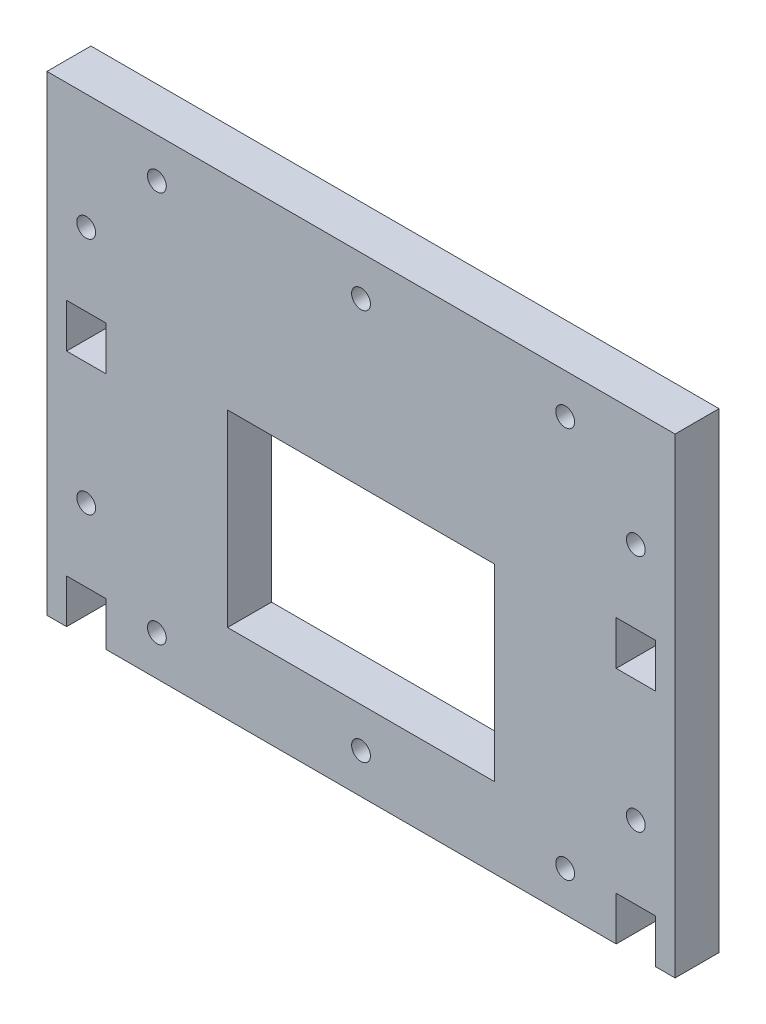
ISO-10303-21;
HEADER;
FILE_DESCRIPTION(('STEP AP214'),'2;1');
FILE_NAME('part.step','',(''),(''),'','','');
FILE_SCHEMA(('AUTOMOTIVE_DESIGN { 1 0 10303 214 1 1 1 1 }'));
ENDSEC;
DATA;
#1=APPLICATION_CONTEXT('core data for automotive mechanical design processes');
#2=APPLICATION_PROTOCOL_DEFINITION('international standard','automotive_design',2000,#1);
#3=PRODUCT_CONTEXT('',#1,'mechanical');
#4=PRODUCT('Part','Part','',(#3));
#5=PRODUCT_RELATED_PRODUCT_CATEGORY('part','',(#4));
#6=PRODUCT_DEFINITION_FORMATION('','',#4);
#7=PRODUCT_DEFINITION_CONTEXT('part definition',#1,'design');
#8=PRODUCT_DEFINITION('design','',#6,#7);
#9=PRODUCT_DEFINITION_SHAPE('','',#8);
#10=(LENGTH_UNIT() NAMED_UNIT(*) SI_UNIT(.MILLI.,.METRE.));
#11=(NAMED_UNIT(*) PLANE_ANGLE_UNIT() SI_UNIT($,.RADIAN.));
#12=(NAMED_UNIT(*) SI_UNIT($,.STERADIAN.) SOLID_ANGLE_UNIT());
#13=UNCERTAINTY_MEASURE_WITH_UNIT(LENGTH_MEASURE(1.E-05),#10,'distance_accuracy_value','');
#14=(GEOMETRIC_REPRESENTATION_CONTEXT(3) GLOBAL_UNCERTAINTY_ASSIGNED_CONTEXT((#13)) GLOBAL_UNIT_ASSIGNED_CONTEXT((#10,
#11,#12)) REPRESENTATION_CONTEXT('',''));
#15=CARTESIAN_POINT('',(0.,0.,0.));
#16=DIRECTION('',(0.,0.,1.));
#17=DIRECTION('',(1.,0.,0.));
#18=AXIS2_PLACEMENT_3D('',#15,#16,#17);
#19=CARTESIAN_POINT('',(0.,0.,14.));
#20=DIRECTION('',(0.,1.,0.));
#21=DIRECTION('',(0.,0.,1.));
#22=AXIS2_PLACEMENT_3D('',#19,#20,#21);
#23=PLANE('',#22);
#24=DIRECTION('',(1.,0.,0.));
#25=VECTOR('',#24,1.);
#26=CARTESIAN_POINT('',(0.,0.,14.));
#27=LINE('',#26,#25);
#28=CARTESIAN_POINT('',(18.7499999999999,0.,14.));
#29=VERTEX_POINT('',#28);
#30=CARTESIAN_POINT('',(181.25,0.,14.));
#31=VERTEX_POINT('',#30);
#32=EDGE_CURVE('E418',#29,#31,#27,.T.);
#33=ORIENTED_EDGE('',*,*,#32,.F.);
#34=DIRECTION('',(0.,0.,-1.));
#35=VECTOR('',#34,1.);
#36=CARTESIAN_POINT('',(18.7499999999999,0.,32.7683243791235));
#37=LINE('',#36,#35);
#38=CARTESIAN_POINT('',(18.7499999999999,0.,0.));
#39=VERTEX_POINT('',#38);
#40=EDGE_CURVE('E372',#29,#39,#37,.T.);
#41=ORIENTED_EDGE('',*,*,#40,.T.);
#42=DIRECTION('',(1.,0.,0.));
#43=VECTOR('',#42,1.);
#44=CARTESIAN_POINT('',(0.,0.,0.));
#45=LINE('',#44,#43);
#46=CARTESIAN_POINT('',(181.25,0.,0.));
#47=VERTEX_POINT('',#46);
#48=EDGE_CURVE('E430',#39,#47,#45,.T.);
#49=ORIENTED_EDGE('',*,*,#48,.T.);
#50=DIRECTION('',(0.,0.,-1.));
#51=VECTOR('',#50,1.);
#52=CARTESIAN_POINT('',(181.25,0.,32.7683243791235));
#53=LINE('',#52,#51);
#54=EDGE_CURVE('E324',#31,#47,#53,.T.);
#55=ORIENTED_EDGE('',*,*,#54,.F.);
#56=EDGE_LOOP('',(#33,#41,#49,#55));
#57=FACE_BOUND('',#56,.T.);
#58=ADVANCED_FACE('F47',(#57),#23,.F.);
#59=CARTESIAN_POINT('',(193.75,0.,14.));
#60=VERTEX_POINT('',#59);
#61=CARTESIAN_POINT('',(200.,0.,14.));
#62=VERTEX_POINT('',#61);
#63=EDGE_CURVE('E412',#60,#62,#27,.T.);
#64=ORIENTED_EDGE('',*,*,#63,.F.);
#65=DIRECTION('',(0.,0.,-1.));
#66=VECTOR('',#65,1.);
#67=CARTESIAN_POINT('',(193.75,0.,32.7683243791235));
#68=LINE('',#67,#66);
#69=CARTESIAN_POINT('',(193.75,0.,0.));
#70=VERTEX_POINT('',#69);
#71=EDGE_CURVE('E320',#60,#70,#68,.T.);
#72=ORIENTED_EDGE('',*,*,#71,.T.);
#73=CARTESIAN_POINT('',(200.,0.,0.));
#74=VERTEX_POINT('',#73);
#75=EDGE_CURVE('E425',#70,#74,#45,.T.);
#76=ORIENTED_EDGE('',*,*,#75,.T.);
#77=DIRECTION('',(0.,0.,-1.));
#78=VECTOR('',#77,1.);
#79=CARTESIAN_POINT('',(200.,0.,14.));
#80=LINE('',#79,#78);
#81=EDGE_CURVE('E55',#62,#74,#80,.T.);
#82=ORIENTED_EDGE('',*,*,#81,.F.);
#83=EDGE_LOOP('',(#64,#72,#76,#82));
#84=FACE_BOUND('',#83,.T.);
#85=ADVANCED_FACE('F484',(#84),#23,.F.);
#86=CARTESIAN_POINT('',(0.,0.,14.));
#87=DIRECTION('',(1.,0.,0.));
#88=DIRECTION('',(0.,0.,-1.));
#89=AXIS2_PLACEMENT_3D('',#86,#87,#88);
#90=PLANE('',#89);
#91=DIRECTION('',(0.,-1.,0.));
#92=VECTOR('',#91,1.);
#93=CARTESIAN_POINT('',(0.,0.,0.));
#94=LINE('',#93,#92);
#95=CARTESIAN_POINT('',(0.,150.,0.));
#96=VERTEX_POINT('',#95);
#97=CARTESIAN_POINT('',(0.,0.,0.));
#98=VERTEX_POINT('',#97);
#99=EDGE_CURVE('E408',#96,#98,#94,.T.);
#100=ORIENTED_EDGE('',*,*,#99,.T.);
#101=DIRECTION('',(0.,0.,-1.));
#102=VECTOR('',#101,1.);
#103=CARTESIAN_POINT('',(0.,0.,14.));
#104=LINE('',#103,#102);
#105=CARTESIAN_POINT('',(0.,0.,14.));
#106=VERTEX_POINT('',#105);
#107=EDGE_CURVE('E11',#106,#98,#104,.T.);
#108=ORIENTED_EDGE('',*,*,#107,.F.);
#109=DIRECTION('',(0.,-1.,0.));
#110=VECTOR('',#109,1.);
#111=CARTESIAN_POINT('',(0.,0.,14.));
#112=LINE('',#111,#110);
#113=CARTESIAN_POINT('',(0.,150.,14.));
#114=VERTEX_POINT('',#113);
#115=EDGE_CURVE('E409',#114,#106,#112,.T.);
#116=ORIENTED_EDGE('',*,*,#115,.F.);
#117=DIRECTION('',(0.,0.,-1.));
#118=VECTOR('',#117,1.);
#119=CARTESIAN_POINT('',(0.,150.,14.));
#120=LINE('',#119,#118);
#121=EDGE_CURVE('E422',#114,#96,#120,.T.);
#122=ORIENTED_EDGE('',*,*,#121,.T.);
#123=EDGE_LOOP('',(#100,#108,#116,#122));
#124=FACE_BOUND('',#123,.T.);
#125=ADVANCED_FACE('F49',(#124),#90,.F.);
#126=CARTESIAN_POINT('',(6.24999999999989,0.,0.));
#127=VERTEX_POINT('',#126);
#128=EDGE_CURVE('E426',#98,#127,#45,.T.);
#129=ORIENTED_EDGE('',*,*,#128,.T.);
#130=DIRECTION('',(0.,0.,-1.));
#131=VECTOR('',#130,1.);
#132=CARTESIAN_POINT('',(6.24999999999989,0.,32.7683243791235));
#133=LINE('',#132,#131);
#134=CARTESIAN_POINT('',(6.24999999999989,0.,14.));
#135=VERTEX_POINT('',#134);
#136=EDGE_CURVE('E376',#135,#127,#133,.T.);
#137=ORIENTED_EDGE('',*,*,#136,.F.);
#138=EDGE_CURVE('E414',#106,#135,#27,.T.);
#139=ORIENTED_EDGE('',*,*,#138,.F.);
#140=ORIENTED_EDGE('',*,*,#107,.T.);
#141=EDGE_LOOP('',(#129,#137,#139,#140));
#142=FACE_BOUND('',#141,.T.);
#143=ADVANCED_FACE('F486',(#142),#23,.F.);
#144=CARTESIAN_POINT('',(200.,0.,14.));
#145=DIRECTION('',(-1.,0.,0.));
#146=DIRECTION('',(0.,0.,1.));
#147=AXIS2_PLACEMENT_3D('',#144,#145,#146);
#148=PLANE('',#147);
#149=DIRECTION('',(0.,1.,0.));
#150=VECTOR('',#149,1.);
#151=CARTESIAN_POINT('',(200.,0.,0.));
#152=LINE('',#151,#150);
#153=CARTESIAN_POINT('',(200.,150.,0.));
#154=VERTEX_POINT('',#153);
#155=EDGE_CURVE('E429',#74,#154,#152,.T.);
#156=ORIENTED_EDGE('',*,*,#155,.T.);
#157=DIRECTION('',(0.,0.,-1.));
#158=VECTOR('',#157,1.);
#159=CARTESIAN_POINT('',(200.,150.,14.));
#160=LINE('',#159,#158);
#161=CARTESIAN_POINT('',(200.,150.,14.));
#162=VERTEX_POINT('',#161);
#163=EDGE_CURVE('E435',#162,#154,#160,.T.);
#164=ORIENTED_EDGE('',*,*,#163,.F.);
#165=DIRECTION('',(0.,1.,0.));
#166=VECTOR('',#165,1.);
#167=CARTESIAN_POINT('',(200.,0.,14.));
#168=LINE('',#167,#166);
#169=EDGE_CURVE('E417',#62,#162,#168,.T.);
#170=ORIENTED_EDGE('',*,*,#169,.F.);
#171=ORIENTED_EDGE('',*,*,#81,.T.);
#172=EDGE_LOOP('',(#156,#164,#170,#171));
#173=FACE_BOUND('',#172,.T.);
#174=ADVANCED_FACE('F442',(#173),#148,.F.);
#175=CARTESIAN_POINT('',(0.,150.,14.));
#176=DIRECTION('',(0.,-1.,0.));
#177=DIRECTION('',(0.,0.,-1.));
#178=AXIS2_PLACEMENT_3D('',#175,#176,#177);
#179=PLANE('',#178);
#180=DIRECTION('',(-1.,0.,0.));
#181=VECTOR('',#180,1.);
#182=CARTESIAN_POINT('',(0.,150.,0.));
#183=LINE('',#182,#181);
#184=EDGE_CURVE('E413',#154,#96,#183,.T.);
#185=ORIENTED_EDGE('',*,*,#184,.T.);
#186=ORIENTED_EDGE('',*,*,#121,.F.);
#187=DIRECTION('',(-1.,0.,0.));
#188=VECTOR('',#187,1.);
#189=CARTESIAN_POINT('',(0.,150.,14.));
#190=LINE('',#189,#188);
#191=EDGE_CURVE('E420',#162,#114,#190,.T.);
#192=ORIENTED_EDGE('',*,*,#191,.F.);
#193=ORIENTED_EDGE('',*,*,#163,.T.);
#194=EDGE_LOOP('',(#185,#186,#192,#193));
#195=FACE_BOUND('',#194,.T.);
#196=ADVANCED_FACE('F455',(#195),#179,.F.);
#197=CARTESIAN_POINT('',(0.,0.,14.));
#198=DIRECTION('',(0.,0.,-1.));
#199=DIRECTION('',(-1.,0.,0.));
#200=AXIS2_PLACEMENT_3D('',#197,#198,#199);
#201=PLANE('',#200);
#202=DIRECTION('',(-1.,0.,0.));
#203=VECTOR('',#202,1.);
#204=CARTESIAN_POINT('',(57.5,85.4,14.));
#205=LINE('',#204,#203);
#206=CARTESIAN_POINT('',(142.5,85.4,14.));
#207=VERTEX_POINT('',#206);
#208=CARTESIAN_POINT('',(57.5,85.4,14.));
#209=VERTEX_POINT('',#208);
#210=EDGE_CURVE('E235',#207,#209,#205,.T.);
#211=ORIENTED_EDGE('',*,*,#210,.F.);
#212=DIRECTION('',(0.,1.,0.));
#213=VECTOR('',#212,1.);
#214=CARTESIAN_POINT('',(142.5,25.4,14.));
#215=LINE('',#214,#213);
#216=CARTESIAN_POINT('',(142.5,25.4,14.));
#217=VERTEX_POINT('',#216);
#218=EDGE_CURVE('E62',#217,#207,#215,.T.);
#219=ORIENTED_EDGE('',*,*,#218,.F.);
#220=DIRECTION('',(1.,0.,0.));
#221=VECTOR('',#220,1.);
#222=CARTESIAN_POINT('',(57.5,25.4,14.));
#223=LINE('',#222,#221);
#224=CARTESIAN_POINT('',(57.5,25.4,14.));
#225=VERTEX_POINT('',#224);
#226=EDGE_CURVE('E226',#225,#217,#223,.T.);
#227=ORIENTED_EDGE('',*,*,#226,.F.);
#228=DIRECTION('',(0.,-1.,0.));
#229=VECTOR('',#228,1.);
#230=CARTESIAN_POINT('',(57.5,25.4,14.));
#231=LINE('',#230,#229);
#232=EDGE_CURVE('E229',#209,#225,#231,.T.);
#233=ORIENTED_EDGE('',*,*,#232,.F.);
#234=EDGE_LOOP('',(#211,#219,#227,#233));
#235=FACE_BOUND('',#234,.T.);
#236=CARTESIAN_POINT('',(12.4999999999998,113.265728708568,14.));
#237=DIRECTION('',(0.,0.,1.));
#238=DIRECTION('',(1.,0.,0.));
#239=AXIS2_PLACEMENT_3D('',#236,#237,#238);
#240=CIRCLE('',#239,2.99999999999999);
#241=CARTESIAN_POINT('',(15.4999999999998,113.265728708568,14.));
#242=VERTEX_POINT('',#241);
#243=EDGE_CURVE('E241',#242,#242,#240,.T.);
#244=ORIENTED_EDGE('',*,*,#243,.F.);
#245=EDGE_LOOP('',(#244));
#246=FACE_BOUND('',#245,.T.);
#247=CARTESIAN_POINT('',(187.5,113.265728708568,14.));
#248=DIRECTION('',(0.,0.,1.));
#249=DIRECTION('',(1.,0.,0.));
#250=AXIS2_PLACEMENT_3D('',#247,#248,#249);
#251=CIRCLE('',#250,2.99999999999998);
#252=CARTESIAN_POINT('',(190.5,113.265728708568,14.));
#253=VERTEX_POINT('',#252);
#254=EDGE_CURVE('E250',#253,#253,#251,.T.);
#255=ORIENTED_EDGE('',*,*,#254,.F.);
#256=EDGE_LOOP('',(#255));
#257=FACE_BOUND('',#256,.T.);
#258=CARTESIAN_POINT('',(187.5,37.2657287085675,14.));
#259=DIRECTION('',(0.,0.,1.));
#260=DIRECTION('',(1.,0.,0.));
#261=AXIS2_PLACEMENT_3D('',#258,#259,#260);
#262=CIRCLE('',#261,2.99999999999998);
#263=CARTESIAN_POINT('',(190.5,37.2657287085675,14.));
#264=VERTEX_POINT('',#263);
#265=EDGE_CURVE('E256',#264,#264,#262,.T.);
#266=ORIENTED_EDGE('',*,*,#265,.F.);
#267=EDGE_LOOP('',(#266));
#268=FACE_BOUND('',#267,.T.);
#269=CARTESIAN_POINT('',(12.4999999999998,37.2657287085677,14.));
#270=DIRECTION('',(0.,0.,1.));
#271=DIRECTION('',(1.,0.,0.));
#272=AXIS2_PLACEMENT_3D('',#269,#270,#271);
#273=CIRCLE('',#272,2.99999999999999);
#274=CARTESIAN_POINT('',(15.4999999999998,37.2657287085677,14.));
#275=VERTEX_POINT('',#274);
#276=EDGE_CURVE('E262',#275,#275,#273,.T.);
#277=ORIENTED_EDGE('',*,*,#276,.F.);
#278=EDGE_LOOP('',(#277));
#279=FACE_BOUND('',#278,.T.);
#280=CARTESIAN_POINT('',(35.,137.3,14.));
#281=DIRECTION('',(0.,0.,1.));
#282=DIRECTION('',(1.,0.,0.));
#283=AXIS2_PLACEMENT_3D('',#280,#281,#282);
#284=CIRCLE('',#283,2.99999999999999);
#285=CARTESIAN_POINT('',(38.,137.3,14.));
#286=VERTEX_POINT('',#285);
#287=EDGE_CURVE('E268',#286,#286,#284,.T.);
#288=ORIENTED_EDGE('',*,*,#287,.F.);
#289=EDGE_LOOP('',(#288));
#290=FACE_BOUND('',#289,.T.);
#291=CARTESIAN_POINT('',(100.,137.3,14.));
#292=DIRECTION('',(0.,0.,1.));
#293=DIRECTION('',(1.,0.,0.));
#294=AXIS2_PLACEMENT_3D('',#291,#292,#293);
#295=CIRCLE('',#294,2.99999999999999);
#296=CARTESIAN_POINT('',(103.,137.3,14.));
#297=VERTEX_POINT('',#296);
#298=EDGE_CURVE('E274',#297,#297,#295,.T.);
#299=ORIENTED_EDGE('',*,*,#298,.F.);
#300=EDGE_LOOP('',(#299));
#301=FACE_BOUND('',#300,.T.);
#302=CARTESIAN_POINT('',(165.,137.3,14.));
#303=DIRECTION('',(0.,0.,1.));
#304=DIRECTION('',(1.,0.,0.));
#305=AXIS2_PLACEMENT_3D('',#302,#303,#304);
#306=CIRCLE('',#305,3.);
#307=CARTESIAN_POINT('',(168.,137.3,14.));
#308=VERTEX_POINT('',#307);
#309=EDGE_CURVE('E280',#308,#308,#306,.T.);
#310=ORIENTED_EDGE('',*,*,#309,.F.);
#311=EDGE_LOOP('',(#310));
#312=FACE_BOUND('',#311,.T.);
#313=CARTESIAN_POINT('',(165.,12.7,14.));
#314=DIRECTION('',(0.,0.,1.));
#315=DIRECTION('',(1.,0.,0.));
#316=AXIS2_PLACEMENT_3D('',#313,#314,#315);
#317=CIRCLE('',#316,3.);
#318=CARTESIAN_POINT('',(168.,12.7,14.));
#319=VERTEX_POINT('',#318);
#320=EDGE_CURVE('E286',#319,#319,#317,.T.);
#321=ORIENTED_EDGE('',*,*,#320,.F.);
#322=EDGE_LOOP('',(#321));
#323=FACE_BOUND('',#322,.T.);
#324=CARTESIAN_POINT('',(100.,12.7,14.));
#325=DIRECTION('',(0.,0.,1.));
#326=DIRECTION('',(1.,0.,0.));
#327=AXIS2_PLACEMENT_3D('',#324,#325,#326);
#328=CIRCLE('',#327,2.99999999999999);
#329=CARTESIAN_POINT('',(103.,12.7,14.));
#330=VERTEX_POINT('',#329);
#331=EDGE_CURVE('E292',#330,#330,#328,.T.);
#332=ORIENTED_EDGE('',*,*,#331,.F.);
#333=EDGE_LOOP('',(#332));
#334=FACE_BOUND('',#333,.T.);
#335=CARTESIAN_POINT('',(35.,12.7,14.));
#336=DIRECTION('',(0.,0.,1.));
#337=DIRECTION('',(1.,0.,0.));
#338=AXIS2_PLACEMENT_3D('',#335,#336,#337);
#339=CIRCLE('',#338,2.99999999999999);
#340=CARTESIAN_POINT('',(38.,12.7,14.));
#341=VERTEX_POINT('',#340);
#342=EDGE_CURVE('E298',#341,#341,#339,.T.);
#343=ORIENTED_EDGE('',*,*,#342,.F.);
#344=EDGE_LOOP('',(#343));
#345=FACE_BOUND('',#344,.T.);
#346=DIRECTION('',(-1.,0.,0.));
#347=VECTOR('',#346,1.);
#348=CARTESIAN_POINT('',(181.25,90.,14.));
#349=LINE('',#348,#347);
#350=CARTESIAN_POINT('',(193.75,90.,14.));
#351=VERTEX_POINT('',#350);
#352=CARTESIAN_POINT('',(181.25,90.,14.));
#353=VERTEX_POINT('',#352);
#354=EDGE_CURVE('E331',#351,#353,#349,.T.);
#355=ORIENTED_EDGE('',*,*,#354,.F.);
#356=DIRECTION('',(0.,1.,0.));
#357=VECTOR('',#356,1.);
#358=CARTESIAN_POINT('',(193.75,90.,14.));
#359=LINE('',#358,#357);
#360=CARTESIAN_POINT('',(193.75,76.,14.));
#361=VERTEX_POINT('',#360);
#362=EDGE_CURVE('E334',#361,#351,#359,.T.);
#363=ORIENTED_EDGE('',*,*,#362,.F.);
#364=DIRECTION('',(1.,0.,0.));
#365=VECTOR('',#364,1.);
#366=CARTESIAN_POINT('',(193.75,76.,14.));
#367=LINE('',#366,#365);
#368=CARTESIAN_POINT('',(181.25,76.,14.));
#369=VERTEX_POINT('',#368);
#370=EDGE_CURVE('E336',#369,#361,#367,.T.);
#371=ORIENTED_EDGE('',*,*,#370,.F.);
#372=DIRECTION('',(0.,-1.,0.));
#373=VECTOR('',#372,1.);
#374=CARTESIAN_POINT('',(181.25,76.,14.));
#375=LINE('',#374,#373);
#376=EDGE_CURVE('E328',#353,#369,#375,.T.);
#377=ORIENTED_EDGE('',*,*,#376,.F.);
#378=EDGE_LOOP('',(#355,#363,#371,#377));
#379=FACE_BOUND('',#378,.T.);
#380=DIRECTION('',(-1.,0.,0.));
#381=VECTOR('',#380,1.);
#382=CARTESIAN_POINT('',(6.24999999999989,90.,14.));
#383=LINE('',#382,#381);
#384=CARTESIAN_POINT('',(18.7499999999999,90.,14.));
#385=VERTEX_POINT('',#384);
#386=CARTESIAN_POINT('',(6.24999999999989,90.,14.));
#387=VERTEX_POINT('',#386);
#388=EDGE_CURVE('E383',#385,#387,#383,.T.);
#389=ORIENTED_EDGE('',*,*,#388,.F.);
#390=DIRECTION('',(0.,1.,0.));
#391=VECTOR('',#390,1.);
#392=CARTESIAN_POINT('',(18.7499999999999,90.,14.));
#393=LINE('',#392,#391);
#394=CARTESIAN_POINT('',(18.7499999999999,76.,14.));
#395=VERTEX_POINT('',#394);
#396=EDGE_CURVE('E386',#395,#385,#393,.T.);
#397=ORIENTED_EDGE('',*,*,#396,.F.);
#398=DIRECTION('',(1.,0.,0.));
#399=VECTOR('',#398,1.);
#400=CARTESIAN_POINT('',(18.7499999999999,76.,14.));
#401=LINE('',#400,#399);
#402=CARTESIAN_POINT('',(6.24999999999989,76.,14.));
#403=VERTEX_POINT('',#402);
#404=EDGE_CURVE('E388',#403,#395,#401,.T.);
#405=ORIENTED_EDGE('',*,*,#404,.F.);
#406=DIRECTION('',(0.,-1.,0.));
#407=VECTOR('',#406,1.);
#408=CARTESIAN_POINT('',(6.24999999999989,76.,14.));
#409=LINE('',#408,#407);
#410=EDGE_CURVE('E380',#387,#403,#409,.T.);
#411=ORIENTED_EDGE('',*,*,#410,.F.);
#412=EDGE_LOOP('',(#389,#397,#405,#411));
#413=FACE_BOUND('',#412,.T.);
#414=DIRECTION('',(-1.,0.,0.));
#415=VECTOR('',#414,1.);
#416=CARTESIAN_POINT('',(6.24999999999989,14.,14.));
#417=LINE('',#416,#415);
#418=CARTESIAN_POINT('',(18.7499999999999,14.,14.));
#419=VERTEX_POINT('',#418);
#420=CARTESIAN_POINT('',(6.24999999999989,14.,14.));
#421=VERTEX_POINT('',#420);
#422=EDGE_CURVE('E361',#419,#421,#417,.T.);
#423=ORIENTED_EDGE('',*,*,#422,.F.);
#424=DIRECTION('',(0.,1.,0.));
#425=VECTOR('',#424,1.);
#426=CARTESIAN_POINT('',(18.7499999999999,14.,14.));
#427=LINE('',#426,#425);
#428=EDGE_CURVE('E340',#29,#419,#427,.T.);
#429=ORIENTED_EDGE('',*,*,#428,.F.);
#430=ORIENTED_EDGE('',*,*,#32,.T.);
#431=DIRECTION('',(0.,-1.,0.));
#432=VECTOR('',#431,1.);
#433=CARTESIAN_POINT('',(181.25,0.,14.));
#434=LINE('',#433,#432);
#435=CARTESIAN_POINT('',(181.25,14.,14.));
#436=VERTEX_POINT('',#435);
#437=EDGE_CURVE('E305',#436,#31,#434,.T.);
#438=ORIENTED_EDGE('',*,*,#437,.F.);
#439=DIRECTION('',(-1.,0.,0.));
#440=VECTOR('',#439,1.);
#441=CARTESIAN_POINT('',(181.25,14.,14.));
#442=LINE('',#441,#440);
#443=CARTESIAN_POINT('',(193.75,14.,14.));
#444=VERTEX_POINT('',#443);
#445=EDGE_CURVE('E307',#444,#436,#442,.T.);
#446=ORIENTED_EDGE('',*,*,#445,.F.);
#447=DIRECTION('',(0.,1.,0.));
#448=VECTOR('',#447,1.);
#449=CARTESIAN_POINT('',(193.75,14.,14.));
#450=LINE('',#449,#448);
#451=EDGE_CURVE('E310',#60,#444,#450,.T.);
#452=ORIENTED_EDGE('',*,*,#451,.F.);
#453=ORIENTED_EDGE('',*,*,#63,.T.);
#454=ORIENTED_EDGE('',*,*,#169,.T.);
#455=ORIENTED_EDGE('',*,*,#191,.T.);
#456=ORIENTED_EDGE('',*,*,#115,.T.);
#457=ORIENTED_EDGE('',*,*,#138,.T.);
#458=DIRECTION('',(0.,-1.,0.));
#459=VECTOR('',#458,1.);
#460=CARTESIAN_POINT('',(6.24999999999989,0.,14.));
#461=LINE('',#460,#459);
#462=EDGE_CURVE('E359',#421,#135,#461,.T.);
#463=ORIENTED_EDGE('',*,*,#462,.F.);
#464=EDGE_LOOP('',(#423,#429,#430,#438,#446,#452,#453,#454,#455,#456,#457,#463));
#465=FACE_BOUND('',#464,.T.);
#466=ADVANCED_FACE('F462',(#235,#246,#257,#268,#279,#290,#301,#312,#323,#334,#345,#379,#413,
#465),#201,.F.);
#467=CARTESIAN_POINT('',(0.,0.,0.));
#468=DIRECTION('',(0.,0.,-1.));
#469=DIRECTION('',(-1.,0.,0.));
#470=AXIS2_PLACEMENT_3D('',#467,#468,#469);
#471=PLANE('',#470);
#472=DIRECTION('',(0.,1.,0.));
#473=VECTOR('',#472,1.);
#474=CARTESIAN_POINT('',(142.5,25.4,0.));
#475=LINE('',#474,#473);
#476=CARTESIAN_POINT('',(142.5,25.4,0.));
#477=VERTEX_POINT('',#476);
#478=CARTESIAN_POINT('',(142.5,85.4,0.));
#479=VERTEX_POINT('',#478);
#480=EDGE_CURVE('E210',#477,#479,#475,.T.);
#481=ORIENTED_EDGE('',*,*,#480,.T.);
#482=DIRECTION('',(-1.,0.,0.));
#483=VECTOR('',#482,1.);
#484=CARTESIAN_POINT('',(57.5,85.4,0.));
#485=LINE('',#484,#483);
#486=CARTESIAN_POINT('',(57.5,85.4,0.));
#487=VERTEX_POINT('',#486);
#488=EDGE_CURVE('E219',#479,#487,#485,.T.);
#489=ORIENTED_EDGE('',*,*,#488,.T.);
#490=DIRECTION('',(0.,-1.,0.));
#491=VECTOR('',#490,1.);
#492=CARTESIAN_POINT('',(57.5,25.4,0.));
#493=LINE('',#492,#491);
#494=CARTESIAN_POINT('',(57.5,25.4,0.));
#495=VERTEX_POINT('',#494);
#496=EDGE_CURVE('E70',#487,#495,#493,.T.);
#497=ORIENTED_EDGE('',*,*,#496,.T.);
#498=DIRECTION('',(1.,0.,0.));
#499=VECTOR('',#498,1.);
#500=CARTESIAN_POINT('',(57.5,25.4,0.));
#501=LINE('',#500,#499);
#502=EDGE_CURVE('E216',#495,#477,#501,.T.);
#503=ORIENTED_EDGE('',*,*,#502,.T.);
#504=EDGE_LOOP('',(#481,#489,#497,#503));
#505=FACE_BOUND('',#504,.T.);
#506=CARTESIAN_POINT('',(12.4999999999998,113.265728708568,0.));
#507=DIRECTION('',(0.,0.,1.));
#508=DIRECTION('',(1.,0.,0.));
#509=AXIS2_PLACEMENT_3D('',#506,#507,#508);
#510=CIRCLE('',#509,3.);
#511=CARTESIAN_POINT('',(15.4999999999998,113.265728708568,0.));
#512=VERTEX_POINT('',#511);
#513=EDGE_CURVE('E247',#512,#512,#510,.T.);
#514=ORIENTED_EDGE('',*,*,#513,.T.);
#515=EDGE_LOOP('',(#514));
#516=FACE_BOUND('',#515,.T.);
#517=CARTESIAN_POINT('',(187.5,113.265728708568,0.));
#518=DIRECTION('',(0.,0.,1.));
#519=DIRECTION('',(1.,0.,0.));
#520=AXIS2_PLACEMENT_3D('',#517,#518,#519);
#521=CIRCLE('',#520,3.);
#522=CARTESIAN_POINT('',(190.5,113.265728708568,0.));
#523=VERTEX_POINT('',#522);
#524=EDGE_CURVE('E253',#523,#523,#521,.T.);
#525=ORIENTED_EDGE('',*,*,#524,.T.);
#526=EDGE_LOOP('',(#525));
#527=FACE_BOUND('',#526,.T.);
#528=CARTESIAN_POINT('',(187.5,37.2657287085675,0.));
#529=DIRECTION('',(0.,0.,1.));
#530=DIRECTION('',(1.,0.,0.));
#531=AXIS2_PLACEMENT_3D('',#528,#529,#530);
#532=CIRCLE('',#531,3.);
#533=CARTESIAN_POINT('',(190.5,37.2657287085675,0.));
#534=VERTEX_POINT('',#533);
#535=EDGE_CURVE('E259',#534,#534,#532,.T.);
#536=ORIENTED_EDGE('',*,*,#535,.T.);
#537=EDGE_LOOP('',(#536));
#538=FACE_BOUND('',#537,.T.);
#539=CARTESIAN_POINT('',(12.4999999999998,37.2657287085677,0.));
#540=DIRECTION('',(0.,0.,1.));
#541=DIRECTION('',(1.,0.,0.));
#542=AXIS2_PLACEMENT_3D('',#539,#540,#541);
#543=CIRCLE('',#542,3.);
#544=CARTESIAN_POINT('',(15.4999999999998,37.2657287085677,0.));
#545=VERTEX_POINT('',#544);
#546=EDGE_CURVE('E265',#545,#545,#543,.T.);
#547=ORIENTED_EDGE('',*,*,#546,.T.);
#548=EDGE_LOOP('',(#547));
#549=FACE_BOUND('',#548,.T.);
#550=CARTESIAN_POINT('',(35.,137.3,0.));
#551=DIRECTION('',(0.,0.,1.));
#552=DIRECTION('',(1.,0.,0.));
#553=AXIS2_PLACEMENT_3D('',#550,#551,#552);
#554=CIRCLE('',#553,3.);
#555=CARTESIAN_POINT('',(38.,137.3,0.));
#556=VERTEX_POINT('',#555);
#557=EDGE_CURVE('E271',#556,#556,#554,.T.);
#558=ORIENTED_EDGE('',*,*,#557,.T.);
#559=EDGE_LOOP('',(#558));
#560=FACE_BOUND('',#559,.T.);
#561=CARTESIAN_POINT('',(100.,137.3,0.));
#562=DIRECTION('',(0.,0.,1.));
#563=DIRECTION('',(1.,0.,0.));
#564=AXIS2_PLACEMENT_3D('',#561,#562,#563);
#565=CIRCLE('',#564,3.);
#566=CARTESIAN_POINT('',(103.,137.3,0.));
#567=VERTEX_POINT('',#566);
#568=EDGE_CURVE('E277',#567,#567,#565,.T.);
#569=ORIENTED_EDGE('',*,*,#568,.T.);
#570=EDGE_LOOP('',(#569));
#571=FACE_BOUND('',#570,.T.);
#572=CARTESIAN_POINT('',(165.,137.3,0.));
#573=DIRECTION('',(0.,0.,1.));
#574=DIRECTION('',(1.,0.,0.));
#575=AXIS2_PLACEMENT_3D('',#572,#573,#574);
#576=CIRCLE('',#575,3.);
#577=CARTESIAN_POINT('',(168.,137.3,0.));
#578=VERTEX_POINT('',#577);
#579=EDGE_CURVE('E283',#578,#578,#576,.T.);
#580=ORIENTED_EDGE('',*,*,#579,.T.);
#581=EDGE_LOOP('',(#580));
#582=FACE_BOUND('',#581,.T.);
#583=CARTESIAN_POINT('',(165.,12.7,0.));
#584=DIRECTION('',(0.,0.,1.));
#585=DIRECTION('',(1.,0.,0.));
#586=AXIS2_PLACEMENT_3D('',#583,#584,#585);
#587=CIRCLE('',#586,3.);
#588=CARTESIAN_POINT('',(168.,12.7,0.));
#589=VERTEX_POINT('',#588);
#590=EDGE_CURVE('E289',#589,#589,#587,.T.);
#591=ORIENTED_EDGE('',*,*,#590,.T.);
#592=EDGE_LOOP('',(#591));
#593=FACE_BOUND('',#592,.T.);
#594=CARTESIAN_POINT('',(100.,12.7,0.));
#595=DIRECTION('',(0.,0.,1.));
#596=DIRECTION('',(1.,0.,0.));
#597=AXIS2_PLACEMENT_3D('',#594,#595,#596);
#598=CIRCLE('',#597,3.);
#599=CARTESIAN_POINT('',(103.,12.7,0.));
#600=VERTEX_POINT('',#599);
#601=EDGE_CURVE('E295',#600,#600,#598,.T.);
#602=ORIENTED_EDGE('',*,*,#601,.T.);
#603=EDGE_LOOP('',(#602));
#604=FACE_BOUND('',#603,.T.);
#605=CARTESIAN_POINT('',(35.,12.7,0.));
#606=DIRECTION('',(0.,0.,1.));
#607=DIRECTION('',(1.,0.,0.));
#608=AXIS2_PLACEMENT_3D('',#605,#606,#607);
#609=CIRCLE('',#608,3.);
#610=CARTESIAN_POINT('',(38.,12.7,0.));
#611=VERTEX_POINT('',#610);
#612=EDGE_CURVE('E301',#611,#611,#609,.T.);
#613=ORIENTED_EDGE('',*,*,#612,.T.);
#614=EDGE_LOOP('',(#613));
#615=FACE_BOUND('',#614,.T.);
#616=DIRECTION('',(0.,-1.,0.));
#617=VECTOR('',#616,1.);
#618=CARTESIAN_POINT('',(193.75,90.,0.));
#619=LINE('',#618,#617);
#620=CARTESIAN_POINT('',(193.75,90.,0.));
#621=VERTEX_POINT('',#620);
#622=CARTESIAN_POINT('',(193.75,76.,0.));
#623=VERTEX_POINT('',#622);
#624=EDGE_CURVE('E337',#621,#623,#619,.T.);
#625=ORIENTED_EDGE('',*,*,#624,.F.);
#626=DIRECTION('',(1.,0.,0.));
#627=VECTOR('',#626,1.);
#628=CARTESIAN_POINT('',(181.25,90.,0.));
#629=LINE('',#628,#627);
#630=CARTESIAN_POINT('',(181.25,90.,0.));
#631=VERTEX_POINT('',#630);
#632=EDGE_CURVE('E346',#631,#621,#629,.T.);
#633=ORIENTED_EDGE('',*,*,#632,.F.);
#634=DIRECTION('',(0.,1.,0.));
#635=VECTOR('',#634,1.);
#636=CARTESIAN_POINT('',(181.25,76.,0.));
#637=LINE('',#636,#635);
#638=CARTESIAN_POINT('',(181.25,76.,0.));
#639=VERTEX_POINT('',#638);
#640=EDGE_CURVE('E343',#639,#631,#637,.T.);
#641=ORIENTED_EDGE('',*,*,#640,.F.);
#642=DIRECTION('',(-1.,0.,0.));
#643=VECTOR('',#642,1.);
#644=CARTESIAN_POINT('',(193.75,76.,0.));
#645=LINE('',#644,#643);
#646=EDGE_CURVE('E339',#623,#639,#645,.T.);
#647=ORIENTED_EDGE('',*,*,#646,.F.);
#648=EDGE_LOOP('',(#625,#633,#641,#647));
#649=FACE_BOUND('',#648,.T.);
#650=DIRECTION('',(0.,-1.,0.));
#651=VECTOR('',#650,1.);
#652=CARTESIAN_POINT('',(18.7499999999999,14.,0.));
#653=LINE('',#652,#651);
#654=CARTESIAN_POINT('',(18.7499999999999,14.,0.));
#655=VERTEX_POINT('',#654);
#656=EDGE_CURVE('E312',#655,#39,#653,.T.);
#657=ORIENTED_EDGE('',*,*,#656,.F.);
#658=DIRECTION('',(1.,0.,0.));
#659=VECTOR('',#658,1.);
#660=CARTESIAN_POINT('',(6.24999999999989,14.,0.));
#661=LINE('',#660,#659);
#662=CARTESIAN_POINT('',(6.24999999999989,14.,0.));
#663=VERTEX_POINT('',#662);
#664=EDGE_CURVE('E369',#663,#655,#661,.T.);
#665=ORIENTED_EDGE('',*,*,#664,.F.);
#666=DIRECTION('',(0.,1.,0.));
#667=VECTOR('',#666,1.);
#668=CARTESIAN_POINT('',(6.24999999999989,0.,0.));
#669=LINE('',#668,#667);
#670=EDGE_CURVE('E366',#127,#663,#669,.T.);
#671=ORIENTED_EDGE('',*,*,#670,.F.);
#672=ORIENTED_EDGE('',*,*,#128,.F.);
#673=ORIENTED_EDGE('',*,*,#99,.F.);
#674=ORIENTED_EDGE('',*,*,#184,.F.);
#675=ORIENTED_EDGE('',*,*,#155,.F.);
#676=ORIENTED_EDGE('',*,*,#75,.F.);
#677=DIRECTION('',(0.,-1.,0.));
#678=VECTOR('',#677,1.);
#679=CARTESIAN_POINT('',(193.75,14.,0.));
#680=LINE('',#679,#678);
#681=CARTESIAN_POINT('',(193.75,14.,0.));
#682=VERTEX_POINT('',#681);
#683=EDGE_CURVE('E304',#682,#70,#680,.T.);
#684=ORIENTED_EDGE('',*,*,#683,.F.);
#685=DIRECTION('',(1.,0.,0.));
#686=VECTOR('',#685,1.);
#687=CARTESIAN_POINT('',(181.25,14.,0.));
#688=LINE('',#687,#686);
#689=CARTESIAN_POINT('',(181.25,14.,0.));
#690=VERTEX_POINT('',#689);
#691=EDGE_CURVE('E317',#690,#682,#688,.T.);
#692=ORIENTED_EDGE('',*,*,#691,.F.);
#693=DIRECTION('',(0.,1.,0.));
#694=VECTOR('',#693,1.);
#695=CARTESIAN_POINT('',(181.25,0.,0.));
#696=LINE('',#695,#694);
#697=EDGE_CURVE('E314',#47,#690,#696,.T.);
#698=ORIENTED_EDGE('',*,*,#697,.F.);
#699=ORIENTED_EDGE('',*,*,#48,.F.);
#700=EDGE_LOOP('',(#657,#665,#671,#672,#673,#674,#675,#676,#684,#692,#698,#699));
#701=FACE_BOUND('',#700,.T.);
#702=DIRECTION('',(0.,-1.,0.));
#703=VECTOR('',#702,1.);
#704=CARTESIAN_POINT('',(18.7499999999999,90.,0.));
#705=LINE('',#704,#703);
#706=CARTESIAN_POINT('',(18.7499999999999,90.,0.));
#707=VERTEX_POINT('',#706);
#708=CARTESIAN_POINT('',(18.7499999999999,76.,0.));
#709=VERTEX_POINT('',#708);
#710=EDGE_CURVE('E358',#707,#709,#705,.T.);
#711=ORIENTED_EDGE('',*,*,#710,.F.);
#712=DIRECTION('',(1.,0.,0.));
#713=VECTOR('',#712,1.);
#714=CARTESIAN_POINT('',(6.24999999999989,90.,0.));
#715=LINE('',#714,#713);
#716=CARTESIAN_POINT('',(6.24999999999989,90.,0.));
#717=VERTEX_POINT('',#716);
#718=EDGE_CURVE('E396',#717,#707,#715,.T.);
#719=ORIENTED_EDGE('',*,*,#718,.F.);
#720=DIRECTION('',(0.,1.,0.));
#721=VECTOR('',#720,1.);
#722=CARTESIAN_POINT('',(6.24999999999989,76.,0.));
#723=LINE('',#722,#721);
#724=CARTESIAN_POINT('',(6.24999999999989,76.,0.));
#725=VERTEX_POINT('',#724);
#726=EDGE_CURVE('E393',#725,#717,#723,.T.);
#727=ORIENTED_EDGE('',*,*,#726,.F.);
#728=DIRECTION('',(-1.,0.,0.));
#729=VECTOR('',#728,1.);
#730=CARTESIAN_POINT('',(18.7499999999999,76.,0.));
#731=LINE('',#730,#729);
#732=EDGE_CURVE('E390',#709,#725,#731,.T.);
#733=ORIENTED_EDGE('',*,*,#732,.F.);
#734=EDGE_LOOP('',(#711,#719,#727,#733));
#735=FACE_BOUND('',#734,.T.);
#736=ADVANCED_FACE('F223',(#505,#516,#527,#538,#549,#560,#571,#582,#593,#604,#615,#649,#701,
#735),#471,.T.);
#737=CARTESIAN_POINT('',(18.7499999999999,90.,32.7683243791235));
#738=DIRECTION('',(1.,0.,0.));
#739=DIRECTION('',(0.,0.,-1.));
#740=AXIS2_PLACEMENT_3D('',#737,#738,#739);
#741=PLANE('',#740);
#742=ORIENTED_EDGE('',*,*,#396,.T.);
#743=DIRECTION('',(0.,0.,-1.));
#744=VECTOR('',#743,1.);
#745=CARTESIAN_POINT('',(18.7499999999999,90.,32.7683243791235));
#746=LINE('',#745,#744);
#747=EDGE_CURVE('E384',#385,#707,#746,.T.);
#748=ORIENTED_EDGE('',*,*,#747,.T.);
#749=ORIENTED_EDGE('',*,*,#710,.T.);
#750=DIRECTION('',(0.,0.,-1.));
#751=VECTOR('',#750,1.);
#752=CARTESIAN_POINT('',(18.7499999999999,76.,32.7683243791235));
#753=LINE('',#752,#751);
#754=EDGE_CURVE('E399',#395,#709,#753,.T.);
#755=ORIENTED_EDGE('',*,*,#754,.F.);
#756=EDGE_LOOP('',(#742,#748,#749,#755));
#757=FACE_BOUND('',#756,.T.);
#758=ADVANCED_FACE('F523',(#757),#741,.F.);
#759=CARTESIAN_POINT('',(6.24999999999989,90.,32.7683243791235));
#760=DIRECTION('',(0.,1.,0.));
#761=DIRECTION('',(0.,0.,1.));
#762=AXIS2_PLACEMENT_3D('',#759,#760,#761);
#763=PLANE('',#762);
#764=ORIENTED_EDGE('',*,*,#388,.T.);
#765=DIRECTION('',(0.,0.,-1.));
#766=VECTOR('',#765,1.);
#767=CARTESIAN_POINT('',(6.24999999999989,90.,32.7683243791235));
#768=LINE('',#767,#766);
#769=EDGE_CURVE('E401',#387,#717,#768,.T.);
#770=ORIENTED_EDGE('',*,*,#769,.T.);
#771=ORIENTED_EDGE('',*,*,#718,.T.);
#772=ORIENTED_EDGE('',*,*,#747,.F.);
#773=EDGE_LOOP('',(#764,#770,#771,#772));
#774=FACE_BOUND('',#773,.T.);
#775=ADVANCED_FACE('F519',(#774),#763,.F.);
#776=CARTESIAN_POINT('',(6.24999999999989,76.,32.7683243791235));
#777=DIRECTION('',(-1.,0.,0.));
#778=DIRECTION('',(0.,0.,1.));
#779=AXIS2_PLACEMENT_3D('',#776,#777,#778);
#780=PLANE('',#779);
#781=ORIENTED_EDGE('',*,*,#410,.T.);
#782=DIRECTION('',(0.,0.,-1.));
#783=VECTOR('',#782,1.);
#784=CARTESIAN_POINT('',(6.24999999999989,76.,32.7683243791235));
#785=LINE('',#784,#783);
#786=EDGE_CURVE('E403',#403,#725,#785,.T.);
#787=ORIENTED_EDGE('',*,*,#786,.T.);
#788=ORIENTED_EDGE('',*,*,#726,.T.);
#789=ORIENTED_EDGE('',*,*,#769,.F.);
#790=EDGE_LOOP('',(#781,#787,#788,#789));
#791=FACE_BOUND('',#790,.T.);
#792=ADVANCED_FACE('F522',(#791),#780,.F.);
#793=CARTESIAN_POINT('',(18.7499999999999,76.,32.7683243791235));
#794=DIRECTION('',(0.,-1.,0.));
#795=DIRECTION('',(0.,0.,-1.));
#796=AXIS2_PLACEMENT_3D('',#793,#794,#795);
#797=PLANE('',#796);
#798=ORIENTED_EDGE('',*,*,#404,.T.);
#799=ORIENTED_EDGE('',*,*,#754,.T.);
#800=ORIENTED_EDGE('',*,*,#732,.T.);
#801=ORIENTED_EDGE('',*,*,#786,.F.);
#802=EDGE_LOOP('',(#798,#799,#800,#801));
#803=FACE_BOUND('',#802,.T.);
#804=ADVANCED_FACE('F527',(#803),#797,.F.);
#805=CARTESIAN_POINT('',(193.75,14.,32.7683243791235));
#806=DIRECTION('',(1.,0.,0.));
#807=DIRECTION('',(0.,0.,-1.));
#808=AXIS2_PLACEMENT_3D('',#805,#806,#807);
#809=PLANE('',#808);
#810=ORIENTED_EDGE('',*,*,#451,.T.);
#811=DIRECTION('',(0.,0.,-1.));
#812=VECTOR('',#811,1.);
#813=CARTESIAN_POINT('',(193.75,14.,32.7683243791235));
#814=LINE('',#813,#812);
#815=EDGE_CURVE('E308',#444,#682,#814,.T.);
#816=ORIENTED_EDGE('',*,*,#815,.T.);
#817=ORIENTED_EDGE('',*,*,#683,.T.);
#818=ORIENTED_EDGE('',*,*,#71,.F.);
#819=EDGE_LOOP('',(#810,#816,#817,#818));
#820=FACE_BOUND('',#819,.T.);
#821=ADVANCED_FACE('F483',(#820),#809,.F.);
#822=CARTESIAN_POINT('',(181.25,14.,32.7683243791235));
#823=DIRECTION('',(0.,1.,0.));
#824=DIRECTION('',(0.,0.,1.));
#825=AXIS2_PLACEMENT_3D('',#822,#823,#824);
#826=PLANE('',#825);
#827=ORIENTED_EDGE('',*,*,#445,.T.);
#828=DIRECTION('',(0.,0.,-1.));
#829=VECTOR('',#828,1.);
#830=CARTESIAN_POINT('',(181.25,14.,32.7683243791235));
#831=LINE('',#830,#829);
#832=EDGE_CURVE('E322',#436,#690,#831,.T.);
#833=ORIENTED_EDGE('',*,*,#832,.T.);
#834=ORIENTED_EDGE('',*,*,#691,.T.);
#835=ORIENTED_EDGE('',*,*,#815,.F.);
#836=EDGE_LOOP('',(#827,#833,#834,#835));
#837=FACE_BOUND('',#836,.T.);
#838=ADVANCED_FACE('F481',(#837),#826,.F.);
#839=CARTESIAN_POINT('',(181.25,0.,32.7683243791235));
#840=DIRECTION('',(-1.,0.,0.));
#841=DIRECTION('',(0.,0.,1.));
#842=AXIS2_PLACEMENT_3D('',#839,#840,#841);
#843=PLANE('',#842);
#844=ORIENTED_EDGE('',*,*,#437,.T.);
#845=ORIENTED_EDGE('',*,*,#54,.T.);
#846=ORIENTED_EDGE('',*,*,#697,.T.);
#847=ORIENTED_EDGE('',*,*,#832,.F.);
#848=EDGE_LOOP('',(#844,#845,#846,#847));
#849=FACE_BOUND('',#848,.T.);
#850=ADVANCED_FACE('F476',(#849),#843,.F.);
#851=CARTESIAN_POINT('',(18.7499999999999,14.,32.7683243791235));
#852=DIRECTION('',(1.,0.,0.));
#853=DIRECTION('',(0.,0.,-1.));
#854=AXIS2_PLACEMENT_3D('',#851,#852,#853);
#855=PLANE('',#854);
#856=ORIENTED_EDGE('',*,*,#428,.T.);
#857=DIRECTION('',(0.,0.,-1.));
#858=VECTOR('',#857,1.);
#859=CARTESIAN_POINT('',(18.7499999999999,14.,32.7683243791235));
#860=LINE('',#859,#858);
#861=EDGE_CURVE('E362',#419,#655,#860,.T.);
#862=ORIENTED_EDGE('',*,*,#861,.T.);
#863=ORIENTED_EDGE('',*,*,#656,.T.);
#864=ORIENTED_EDGE('',*,*,#40,.F.);
#865=EDGE_LOOP('',(#856,#862,#863,#864));
#866=FACE_BOUND('',#865,.T.);
#867=ADVANCED_FACE('F508',(#866),#855,.F.);
#868=CARTESIAN_POINT('',(6.24999999999989,14.,32.7683243791235));
#869=DIRECTION('',(0.,1.,0.));
#870=DIRECTION('',(0.,0.,1.));
#871=AXIS2_PLACEMENT_3D('',#868,#869,#870);
#872=PLANE('',#871);
#873=ORIENTED_EDGE('',*,*,#422,.T.);
#874=DIRECTION('',(0.,0.,-1.));
#875=VECTOR('',#874,1.);
#876=CARTESIAN_POINT('',(6.24999999999989,14.,32.7683243791235));
#877=LINE('',#876,#875);
#878=EDGE_CURVE('E374',#421,#663,#877,.T.);
#879=ORIENTED_EDGE('',*,*,#878,.T.);
#880=ORIENTED_EDGE('',*,*,#664,.T.);
#881=ORIENTED_EDGE('',*,*,#861,.F.);
#882=EDGE_LOOP('',(#873,#879,#880,#881));
#883=FACE_BOUND('',#882,.T.);
#884=ADVANCED_FACE('F506',(#883),#872,.F.);
#885=CARTESIAN_POINT('',(6.24999999999989,0.,32.7683243791235));
#886=DIRECTION('',(-1.,0.,0.));
#887=DIRECTION('',(0.,0.,1.));
#888=AXIS2_PLACEMENT_3D('',#885,#886,#887);
#889=PLANE('',#888);
#890=ORIENTED_EDGE('',*,*,#462,.T.);
#891=ORIENTED_EDGE('',*,*,#136,.T.);
#892=ORIENTED_EDGE('',*,*,#670,.T.);
#893=ORIENTED_EDGE('',*,*,#878,.F.);
#894=EDGE_LOOP('',(#890,#891,#892,#893));
#895=FACE_BOUND('',#894,.T.);
#896=ADVANCED_FACE('F503',(#895),#889,.F.);
#897=CARTESIAN_POINT('',(193.75,90.,32.7683243791235));
#898=DIRECTION('',(1.,0.,0.));
#899=DIRECTION('',(0.,0.,-1.));
#900=AXIS2_PLACEMENT_3D('',#897,#898,#899);
#901=PLANE('',#900);
#902=ORIENTED_EDGE('',*,*,#362,.T.);
#903=DIRECTION('',(0.,0.,-1.));
#904=VECTOR('',#903,1.);
#905=CARTESIAN_POINT('',(193.75,90.,32.7683243791235));
#906=LINE('',#905,#904);
#907=EDGE_CURVE('E332',#351,#621,#906,.T.);
#908=ORIENTED_EDGE('',*,*,#907,.T.);
#909=ORIENTED_EDGE('',*,*,#624,.T.);
#910=DIRECTION('',(0.,0.,-1.));
#911=VECTOR('',#910,1.);
#912=CARTESIAN_POINT('',(193.75,76.,32.7683243791235));
#913=LINE('',#912,#911);
#914=EDGE_CURVE('E349',#361,#623,#913,.T.);
#915=ORIENTED_EDGE('',*,*,#914,.F.);
#916=EDGE_LOOP('',(#902,#908,#909,#915));
#917=FACE_BOUND('',#916,.T.);
#918=ADVANCED_FACE('F597',(#917),#901,.F.);
#919=CARTESIAN_POINT('',(181.25,90.,32.7683243791235));
#920=DIRECTION('',(0.,1.,0.));
#921=DIRECTION('',(-1.,0.,0.));
#922=AXIS2_PLACEMENT_3D('',#919,#920,#921);
#923=PLANE('',#922);
#924=ORIENTED_EDGE('',*,*,#354,.T.);
#925=DIRECTION('',(0.,0.,-1.));
#926=VECTOR('',#925,1.);
#927=CARTESIAN_POINT('',(181.25,90.,32.7683243791235));
#928=LINE('',#927,#926);
#929=EDGE_CURVE('E351',#353,#631,#928,.T.);
#930=ORIENTED_EDGE('',*,*,#929,.T.);
#931=ORIENTED_EDGE('',*,*,#632,.T.);
#932=ORIENTED_EDGE('',*,*,#907,.F.);
#933=EDGE_LOOP('',(#924,#930,#931,#932));
#934=FACE_BOUND('',#933,.T.);
#935=ADVANCED_FACE('F603',(#934),#923,.F.);
#936=CARTESIAN_POINT('',(181.25,76.,32.7683243791235));
#937=DIRECTION('',(-1.,0.,0.));
#938=DIRECTION('',(0.,0.,1.));
#939=AXIS2_PLACEMENT_3D('',#936,#937,#938);
#940=PLANE('',#939);
#941=ORIENTED_EDGE('',*,*,#376,.T.);
#942=DIRECTION('',(0.,0.,-1.));
#943=VECTOR('',#942,1.);
#944=CARTESIAN_POINT('',(181.25,76.,32.7683243791235));
#945=LINE('',#944,#943);
#946=EDGE_CURVE('E353',#369,#639,#945,.T.);
#947=ORIENTED_EDGE('',*,*,#946,.T.);
#948=ORIENTED_EDGE('',*,*,#640,.T.);
#949=ORIENTED_EDGE('',*,*,#929,.F.);
#950=EDGE_LOOP('',(#941,#947,#948,#949));
#951=FACE_BOUND('',#950,.T.);
#952=ADVANCED_FACE('F611',(#951),#940,.F.);
#953=CARTESIAN_POINT('',(193.75,76.,32.7683243791235));
#954=DIRECTION('',(0.,-1.,0.));
#955=DIRECTION('',(0.,0.,-1.));
#956=AXIS2_PLACEMENT_3D('',#953,#954,#955);
#957=PLANE('',#956);
#958=ORIENTED_EDGE('',*,*,#370,.T.);
#959=ORIENTED_EDGE('',*,*,#914,.T.);
#960=ORIENTED_EDGE('',*,*,#646,.T.);
#961=ORIENTED_EDGE('',*,*,#946,.F.);
#962=EDGE_LOOP('',(#958,#959,#960,#961));
#963=FACE_BOUND('',#962,.T.);
#964=ADVANCED_FACE('F619',(#963),#957,.F.);
#965=CARTESIAN_POINT('',(35.,12.7,14.));
#966=DIRECTION('',(0.,0.,1.));
#967=DIRECTION('',(1.,0.,0.));
#968=AXIS2_PLACEMENT_3D('',#965,#966,#967);
#969=CYLINDRICAL_SURFACE('',#968,2.99999999999999);
#970=ORIENTED_EDGE('',*,*,#612,.F.);
#971=EDGE_LOOP('',(#970));
#972=FACE_BOUND('',#971,.T.);
#973=ORIENTED_EDGE('',*,*,#342,.T.);
#974=EDGE_LOOP('',(#973));
#975=FACE_BOUND('',#974,.T.);
#976=ADVANCED_FACE('F627',(#972,#975),#969,.F.);
#977=CARTESIAN_POINT('',(100.,12.7,14.));
#978=DIRECTION('',(0.,0.,1.));
#979=DIRECTION('',(1.,0.,0.));
#980=AXIS2_PLACEMENT_3D('',#977,#978,#979);
#981=CYLINDRICAL_SURFACE('',#980,3.);
#982=ORIENTED_EDGE('',*,*,#601,.F.);
#983=EDGE_LOOP('',(#982));
#984=FACE_BOUND('',#983,.T.);
#985=ORIENTED_EDGE('',*,*,#331,.T.);
#986=EDGE_LOOP('',(#985));
#987=FACE_BOUND('',#986,.T.);
#988=ADVANCED_FACE('F635',(#984,#987),#981,.F.);
#989=CARTESIAN_POINT('',(165.,12.7,14.));
#990=DIRECTION('',(0.,0.,1.));
#991=DIRECTION('',(1.,0.,0.));
#992=AXIS2_PLACEMENT_3D('',#989,#990,#991);
#993=CYLINDRICAL_SURFACE('',#992,3.);
#994=ORIENTED_EDGE('',*,*,#590,.F.);
#995=EDGE_LOOP('',(#994));
#996=FACE_BOUND('',#995,.T.);
#997=ORIENTED_EDGE('',*,*,#320,.T.);
#998=EDGE_LOOP('',(#997));
#999=FACE_BOUND('',#998,.T.);
#1000=ADVANCED_FACE('F643',(#996,#999),#993,.F.);
#1001=CARTESIAN_POINT('',(165.,137.3,14.));
#1002=DIRECTION('',(0.,0.,1.));
#1003=DIRECTION('',(1.,0.,0.));
#1004=AXIS2_PLACEMENT_3D('',#1001,#1002,#1003);
#1005=CYLINDRICAL_SURFACE('',#1004,3.);
#1006=ORIENTED_EDGE('',*,*,#579,.F.);
#1007=EDGE_LOOP('',(#1006));
#1008=FACE_BOUND('',#1007,.T.);
#1009=ORIENTED_EDGE('',*,*,#309,.T.);
#1010=EDGE_LOOP('',(#1009));
#1011=FACE_BOUND('',#1010,.T.);
#1012=ADVANCED_FACE('F651',(#1008,#1011),#1005,.F.);
#1013=CARTESIAN_POINT('',(100.,137.3,14.));
#1014=DIRECTION('',(0.,0.,1.));
#1015=DIRECTION('',(1.,0.,0.));
#1016=AXIS2_PLACEMENT_3D('',#1013,#1014,#1015);
#1017=CYLINDRICAL_SURFACE('',#1016,3.);
#1018=ORIENTED_EDGE('',*,*,#568,.F.);
#1019=EDGE_LOOP('',(#1018));
#1020=FACE_BOUND('',#1019,.T.);
#1021=ORIENTED_EDGE('',*,*,#298,.T.);
#1022=EDGE_LOOP('',(#1021));
#1023=FACE_BOUND('',#1022,.T.);
#1024=ADVANCED_FACE('F659',(#1020,#1023),#1017,.F.);
#1025=CARTESIAN_POINT('',(35.,137.3,14.));
#1026=DIRECTION('',(0.,0.,1.));
#1027=DIRECTION('',(1.,0.,0.));
#1028=AXIS2_PLACEMENT_3D('',#1025,#1026,#1027);
#1029=CYLINDRICAL_SURFACE('',#1028,2.99999999999999);
#1030=ORIENTED_EDGE('',*,*,#557,.F.);
#1031=EDGE_LOOP('',(#1030));
#1032=FACE_BOUND('',#1031,.T.);
#1033=ORIENTED_EDGE('',*,*,#287,.T.);
#1034=EDGE_LOOP('',(#1033));
#1035=FACE_BOUND('',#1034,.T.);
#1036=ADVANCED_FACE('F667',(#1032,#1035),#1029,.F.);
#1037=CARTESIAN_POINT('',(12.4999999999998,37.2657287085677,14.));
#1038=DIRECTION('',(0.,0.,1.));
#1039=DIRECTION('',(1.,0.,0.));
#1040=AXIS2_PLACEMENT_3D('',#1037,#1038,#1039);
#1041=CYLINDRICAL_SURFACE('',#1040,2.99999999999999);
#1042=ORIENTED_EDGE('',*,*,#546,.F.);
#1043=EDGE_LOOP('',(#1042));
#1044=FACE_BOUND('',#1043,.T.);
#1045=ORIENTED_EDGE('',*,*,#276,.T.);
#1046=EDGE_LOOP('',(#1045));
#1047=FACE_BOUND('',#1046,.T.);
#1048=ADVANCED_FACE('F675',(#1044,#1047),#1041,.F.);
#1049=CARTESIAN_POINT('',(187.5,37.2657287085675,14.));
#1050=DIRECTION('',(0.,0.,1.));
#1051=DIRECTION('',(1.,0.,0.));
#1052=AXIS2_PLACEMENT_3D('',#1049,#1050,#1051);
#1053=CYLINDRICAL_SURFACE('',#1052,2.99999999999999);
#1054=ORIENTED_EDGE('',*,*,#535,.F.);
#1055=EDGE_LOOP('',(#1054));
#1056=FACE_BOUND('',#1055,.T.);
#1057=ORIENTED_EDGE('',*,*,#265,.T.);
#1058=EDGE_LOOP('',(#1057));
#1059=FACE_BOUND('',#1058,.T.);
#1060=ADVANCED_FACE('F683',(#1056,#1059),#1053,.F.);
#1061=CARTESIAN_POINT('',(187.5,113.265728708568,14.));
#1062=DIRECTION('',(0.,0.,1.));
#1063=DIRECTION('',(1.,0.,0.));
#1064=AXIS2_PLACEMENT_3D('',#1061,#1062,#1063);
#1065=CYLINDRICAL_SURFACE('',#1064,2.99999999999999);
#1066=ORIENTED_EDGE('',*,*,#524,.F.);
#1067=EDGE_LOOP('',(#1066));
#1068=FACE_BOUND('',#1067,.T.);
#1069=ORIENTED_EDGE('',*,*,#254,.T.);
#1070=EDGE_LOOP('',(#1069));
#1071=FACE_BOUND('',#1070,.T.);
#1072=ADVANCED_FACE('F691',(#1068,#1071),#1065,.F.);
#1073=CARTESIAN_POINT('',(12.4999999999998,113.265728708568,14.));
#1074=DIRECTION('',(0.,0.,1.));
#1075=DIRECTION('',(1.,0.,0.));
#1076=AXIS2_PLACEMENT_3D('',#1073,#1074,#1075);
#1077=CYLINDRICAL_SURFACE('',#1076,2.99999999999999);
#1078=ORIENTED_EDGE('',*,*,#513,.F.);
#1079=EDGE_LOOP('',(#1078));
#1080=FACE_BOUND('',#1079,.T.);
#1081=ORIENTED_EDGE('',*,*,#243,.T.);
#1082=EDGE_LOOP('',(#1081));
#1083=FACE_BOUND('',#1082,.T.);
#1084=ADVANCED_FACE('F699',(#1080,#1083),#1077,.F.);
#1085=CARTESIAN_POINT('',(142.5,25.4,0.));
#1086=DIRECTION('',(1.,0.,0.));
#1087=DIRECTION('',(0.,0.,-1.));
#1088=AXIS2_PLACEMENT_3D('',#1085,#1086,#1087);
#1089=PLANE('',#1088);
#1090=ORIENTED_EDGE('',*,*,#218,.T.);
#1091=DIRECTION('',(0.,0.,1.));
#1092=VECTOR('',#1091,1.);
#1093=CARTESIAN_POINT('',(142.5,85.4,0.));
#1094=LINE('',#1093,#1092);
#1095=EDGE_CURVE('E206',#479,#207,#1094,.T.);
#1096=ORIENTED_EDGE('',*,*,#1095,.F.);
#1097=ORIENTED_EDGE('',*,*,#480,.F.);
#1098=DIRECTION('',(0.,0.,1.));
#1099=VECTOR('',#1098,1.);
#1100=CARTESIAN_POINT('',(142.5,25.4,0.));
#1101=LINE('',#1100,#1099);
#1102=EDGE_CURVE('E239',#477,#217,#1101,.T.);
#1103=ORIENTED_EDGE('',*,*,#1102,.T.);
#1104=EDGE_LOOP('',(#1090,#1096,#1097,#1103));
#1105=FACE_BOUND('',#1104,.T.);
#1106=ADVANCED_FACE('F208',(#1105),#1089,.F.);
#1107=CARTESIAN_POINT('',(57.5,25.4,0.));
#1108=DIRECTION('',(0.,-1.,0.));
#1109=DIRECTION('',(0.,0.,-1.));
#1110=AXIS2_PLACEMENT_3D('',#1107,#1108,#1109);
#1111=PLANE('',#1110);
#1112=ORIENTED_EDGE('',*,*,#226,.T.);
#1113=ORIENTED_EDGE('',*,*,#1102,.F.);
#1114=ORIENTED_EDGE('',*,*,#502,.F.);
#1115=DIRECTION('',(0.,0.,1.));
#1116=VECTOR('',#1115,1.);
#1117=CARTESIAN_POINT('',(57.5,25.4,0.));
#1118=LINE('',#1117,#1116);
#1119=EDGE_CURVE('E242',#495,#225,#1118,.T.);
#1120=ORIENTED_EDGE('',*,*,#1119,.T.);
#1121=EDGE_LOOP('',(#1112,#1113,#1114,#1120));
#1122=FACE_BOUND('',#1121,.T.);
#1123=ADVANCED_FACE('F714',(#1122),#1111,.F.);
#1124=CARTESIAN_POINT('',(57.5,25.4,0.));
#1125=DIRECTION('',(-1.,0.,0.));
#1126=DIRECTION('',(0.,-1.,0.));
#1127=AXIS2_PLACEMENT_3D('',#1124,#1125,#1126);
#1128=PLANE('',#1127);
#1129=ORIENTED_EDGE('',*,*,#232,.T.);
#1130=ORIENTED_EDGE('',*,*,#1119,.F.);
#1131=ORIENTED_EDGE('',*,*,#496,.F.);
#1132=DIRECTION('',(0.,0.,1.));
#1133=VECTOR('',#1132,1.);
#1134=CARTESIAN_POINT('',(57.5,85.4,0.));
#1135=LINE('',#1134,#1133);
#1136=EDGE_CURVE('E215',#487,#209,#1135,.T.);
#1137=ORIENTED_EDGE('',*,*,#1136,.T.);
#1138=EDGE_LOOP('',(#1129,#1130,#1131,#1137));
#1139=FACE_BOUND('',#1138,.T.);
#1140=ADVANCED_FACE('F721',(#1139),#1128,.F.);
#1141=CARTESIAN_POINT('',(57.5,85.4,0.));
#1142=DIRECTION('',(0.,1.,0.));
#1143=DIRECTION('',(0.,0.,1.));
#1144=AXIS2_PLACEMENT_3D('',#1141,#1142,#1143);
#1145=PLANE('',#1144);
#1146=ORIENTED_EDGE('',*,*,#210,.T.);
#1147=ORIENTED_EDGE('',*,*,#1136,.F.);
#1148=ORIENTED_EDGE('',*,*,#488,.F.);
#1149=ORIENTED_EDGE('',*,*,#1095,.T.);
#1150=EDGE_LOOP('',(#1146,#1147,#1148,#1149));
#1151=FACE_BOUND('',#1150,.T.);
#1152=ADVANCED_FACE('F220',(#1151),#1145,.F.);
#1153=CLOSED_SHELL('',(#58,#85,#125,#143,#174,#196,#466,#736,#758,#775,#792,#804,#821,#838,#850,
#867,#884,#896,#918,#935,#952,#964,#976,#988,#1000,#1012,#1024,#1036,#1048,#1060,#1072,#1084,
#1106,#1123,#1140,#1152));
#1154=MANIFOLD_SOLID_BREP('B2',#1153);
#1155=ADVANCED_BREP_SHAPE_REPRESENTATION('',(#18,#1154),#14);
#1156=SHAPE_DEFINITION_REPRESENTATION(#9,#1155);
ENDSEC;
END-ISO-10303-21;
